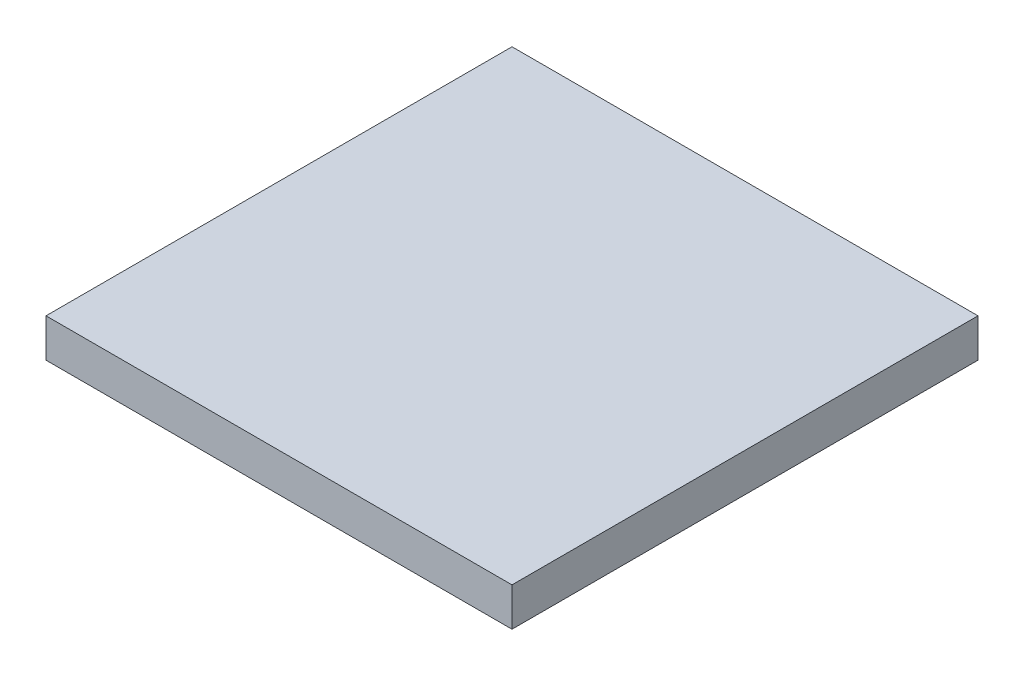
ISO-10303-21;
HEADER;
FILE_DESCRIPTION(('STEP AP214'),'2;1');
FILE_NAME('part.step','',(''),(''),'','','');
FILE_SCHEMA(('AUTOMOTIVE_DESIGN { 1 0 10303 214 1 1 1 1 }'));
ENDSEC;
DATA;
#1=APPLICATION_CONTEXT('core data for automotive mechanical design processes');
#2=APPLICATION_PROTOCOL_DEFINITION('international standard','automotive_design',2000,#1);
#3=PRODUCT_CONTEXT('',#1,'mechanical');
#4=PRODUCT('Part','Part','',(#3));
#5=PRODUCT_RELATED_PRODUCT_CATEGORY('part','',(#4));
#6=PRODUCT_DEFINITION_FORMATION('','',#4);
#7=PRODUCT_DEFINITION_CONTEXT('part definition',#1,'design');
#8=PRODUCT_DEFINITION('design','',#6,#7);
#9=PRODUCT_DEFINITION_SHAPE('','',#8);
#10=(LENGTH_UNIT() NAMED_UNIT(*) SI_UNIT(.MILLI.,.METRE.));
#11=(NAMED_UNIT(*) PLANE_ANGLE_UNIT() SI_UNIT($,.RADIAN.));
#12=(NAMED_UNIT(*) SI_UNIT($,.STERADIAN.) SOLID_ANGLE_UNIT());
#13=UNCERTAINTY_MEASURE_WITH_UNIT(LENGTH_MEASURE(1.E-05),#10,'distance_accuracy_value','');
#14=(GEOMETRIC_REPRESENTATION_CONTEXT(3) GLOBAL_UNCERTAINTY_ASSIGNED_CONTEXT((#13)) GLOBAL_UNIT_ASSIGNED_CONTEXT((#10,
#11,#12)) REPRESENTATION_CONTEXT('',''));
#15=CARTESIAN_POINT('',(0.,0.,0.));
#16=DIRECTION('',(0.,0.,1.));
#17=DIRECTION('',(1.,0.,0.));
#18=AXIS2_PLACEMENT_3D('',#15,#16,#17);
#19=CARTESIAN_POINT('',(20.,3.3,20.));
#20=DIRECTION('',(-1.,0.,0.));
#21=DIRECTION('',(0.,0.,1.));
#22=AXIS2_PLACEMENT_3D('',#19,#20,#21);
#23=PLANE('',#22);
#24=DIRECTION('',(0.,0.,-1.));
#25=VECTOR('',#24,1.);
#26=CARTESIAN_POINT('',(20.,0.,20.));
#27=LINE('',#26,#25);
#28=CARTESIAN_POINT('',(20.,0.,20.));
#29=VERTEX_POINT('',#28);
#30=CARTESIAN_POINT('',(20.,0.,-20.));
#31=VERTEX_POINT('',#30);
#32=EDGE_CURVE('E104',#29,#31,#27,.T.);
#33=ORIENTED_EDGE('',*,*,#32,.T.);
#34=DIRECTION('',(0.,-1.,0.));
#35=VECTOR('',#34,1.);
#36=CARTESIAN_POINT('',(20.,3.3,-20.));
#37=LINE('',#36,#35);
#38=CARTESIAN_POINT('',(20.,3.3,-20.));
#39=VERTEX_POINT('',#38);
#40=EDGE_CURVE('E11',#39,#31,#37,.T.);
#41=ORIENTED_EDGE('',*,*,#40,.F.);
#42=DIRECTION('',(0.,0.,-1.));
#43=VECTOR('',#42,1.);
#44=CARTESIAN_POINT('',(20.,3.3,20.));
#45=LINE('',#44,#43);
#46=CARTESIAN_POINT('',(20.,3.3,20.));
#47=VERTEX_POINT('',#46);
#48=EDGE_CURVE('E92',#47,#39,#45,.T.);
#49=ORIENTED_EDGE('',*,*,#48,.F.);
#50=DIRECTION('',(0.,-1.,0.));
#51=VECTOR('',#50,1.);
#52=CARTESIAN_POINT('',(20.,3.3,20.));
#53=LINE('',#52,#51);
#54=EDGE_CURVE('E100',#47,#29,#53,.T.);
#55=ORIENTED_EDGE('',*,*,#54,.T.);
#56=EDGE_LOOP('',(#33,#41,#49,#55));
#57=FACE_BOUND('',#56,.T.);
#58=ADVANCED_FACE('F41',(#57),#23,.F.);
#59=CARTESIAN_POINT('',(-20.,3.3,-20.));
#60=DIRECTION('',(0.,0.,1.));
#61=DIRECTION('',(1.,0.,0.));
#62=AXIS2_PLACEMENT_3D('',#59,#60,#61);
#63=PLANE('',#62);
#64=DIRECTION('',(-1.,0.,0.));
#65=VECTOR('',#64,1.);
#66=CARTESIAN_POINT('',(-20.,0.,-20.));
#67=LINE('',#66,#65);
#68=CARTESIAN_POINT('',(-20.,0.,-20.));
#69=VERTEX_POINT('',#68);
#70=EDGE_CURVE('E96',#31,#69,#67,.T.);
#71=ORIENTED_EDGE('',*,*,#70,.T.);
#72=DIRECTION('',(0.,-1.,0.));
#73=VECTOR('',#72,1.);
#74=CARTESIAN_POINT('',(-20.,3.3,-20.));
#75=LINE('',#74,#73);
#76=CARTESIAN_POINT('',(-20.,3.3,-20.));
#77=VERTEX_POINT('',#76);
#78=EDGE_CURVE('E49',#77,#69,#75,.T.);
#79=ORIENTED_EDGE('',*,*,#78,.F.);
#80=DIRECTION('',(-1.,0.,0.));
#81=VECTOR('',#80,1.);
#82=CARTESIAN_POINT('',(-20.,3.3,-20.));
#83=LINE('',#82,#81);
#84=EDGE_CURVE('E87',#39,#77,#83,.T.);
#85=ORIENTED_EDGE('',*,*,#84,.F.);
#86=ORIENTED_EDGE('',*,*,#40,.T.);
#87=EDGE_LOOP('',(#71,#79,#85,#86));
#88=FACE_BOUND('',#87,.T.);
#89=ADVANCED_FACE('F95',(#88),#63,.F.);
#90=CARTESIAN_POINT('',(-20.,3.3,20.));
#91=DIRECTION('',(1.,0.,0.));
#92=DIRECTION('',(0.,0.,-1.));
#93=AXIS2_PLACEMENT_3D('',#90,#91,#92);
#94=PLANE('',#93);
#95=DIRECTION('',(0.,0.,1.));
#96=VECTOR('',#95,1.);
#97=CARTESIAN_POINT('',(-20.,0.,20.));
#98=LINE('',#97,#96);
#99=CARTESIAN_POINT('',(-20.,0.,20.));
#100=VERTEX_POINT('',#99);
#101=EDGE_CURVE('E74',#69,#100,#98,.T.);
#102=ORIENTED_EDGE('',*,*,#101,.T.);
#103=DIRECTION('',(0.,-1.,0.));
#104=VECTOR('',#103,1.);
#105=CARTESIAN_POINT('',(-20.,3.3,20.));
#106=LINE('',#105,#104);
#107=CARTESIAN_POINT('',(-20.,3.3,20.));
#108=VERTEX_POINT('',#107);
#109=EDGE_CURVE('E97',#108,#100,#106,.T.);
#110=ORIENTED_EDGE('',*,*,#109,.F.);
#111=DIRECTION('',(0.,0.,1.));
#112=VECTOR('',#111,1.);
#113=CARTESIAN_POINT('',(-20.,3.3,20.));
#114=LINE('',#113,#112);
#115=EDGE_CURVE('E90',#77,#108,#114,.T.);
#116=ORIENTED_EDGE('',*,*,#115,.F.);
#117=ORIENTED_EDGE('',*,*,#78,.T.);
#118=EDGE_LOOP('',(#102,#110,#116,#117));
#119=FACE_BOUND('',#118,.T.);
#120=ADVANCED_FACE('F98',(#119),#94,.F.);
#121=CARTESIAN_POINT('',(-20.,3.3,20.));
#122=DIRECTION('',(0.,0.,-1.));
#123=DIRECTION('',(-1.,0.,0.));
#124=AXIS2_PLACEMENT_3D('',#121,#122,#123);
#125=PLANE('',#124);
#126=DIRECTION('',(1.,0.,0.));
#127=VECTOR('',#126,1.);
#128=CARTESIAN_POINT('',(-20.,0.,20.));
#129=LINE('',#128,#127);
#130=EDGE_CURVE('E80',#100,#29,#129,.T.);
#131=ORIENTED_EDGE('',*,*,#130,.T.);
#132=ORIENTED_EDGE('',*,*,#54,.F.);
#133=DIRECTION('',(1.,0.,0.));
#134=VECTOR('',#133,1.);
#135=CARTESIAN_POINT('',(-20.,3.3,20.));
#136=LINE('',#135,#134);
#137=EDGE_CURVE('E57',#108,#47,#136,.T.);
#138=ORIENTED_EDGE('',*,*,#137,.F.);
#139=ORIENTED_EDGE('',*,*,#109,.T.);
#140=EDGE_LOOP('',(#131,#132,#138,#139));
#141=FACE_BOUND('',#140,.T.);
#142=ADVANCED_FACE('F111',(#141),#125,.F.);
#143=CARTESIAN_POINT('',(0.,3.3,0.));
#144=DIRECTION('',(0.,-1.,0.));
#145=DIRECTION('',(0.,0.,-1.));
#146=AXIS2_PLACEMENT_3D('',#143,#144,#145);
#147=PLANE('',#146);
#148=ORIENTED_EDGE('',*,*,#48,.T.);
#149=ORIENTED_EDGE('',*,*,#84,.T.);
#150=ORIENTED_EDGE('',*,*,#115,.T.);
#151=ORIENTED_EDGE('',*,*,#137,.T.);
#152=EDGE_LOOP('',(#148,#149,#150,#151));
#153=FACE_BOUND('',#152,.T.);
#154=ADVANCED_FACE('F88',(#153),#147,.F.);
#155=CARTESIAN_POINT('',(0.,0.,0.));
#156=DIRECTION('',(0.,-1.,0.));
#157=DIRECTION('',(0.,0.,-1.));
#158=AXIS2_PLACEMENT_3D('',#155,#156,#157);
#159=PLANE('',#158);
#160=ORIENTED_EDGE('',*,*,#32,.F.);
#161=ORIENTED_EDGE('',*,*,#130,.F.);
#162=ORIENTED_EDGE('',*,*,#101,.F.);
#163=ORIENTED_EDGE('',*,*,#70,.F.);
#164=EDGE_LOOP('',(#160,#161,#162,#163));
#165=FACE_BOUND('',#164,.T.);
#166=ADVANCED_FACE('F114',(#165),#159,.T.);
#167=CLOSED_SHELL('',(#58,#89,#120,#142,#154,#166));
#168=MANIFOLD_SOLID_BREP('B2',#167);
#169=ADVANCED_BREP_SHAPE_REPRESENTATION('',(#18,#168),#14);
#170=SHAPE_DEFINITION_REPRESENTATION(#9,#169);
ENDSEC;
END-ISO-10303-21;
